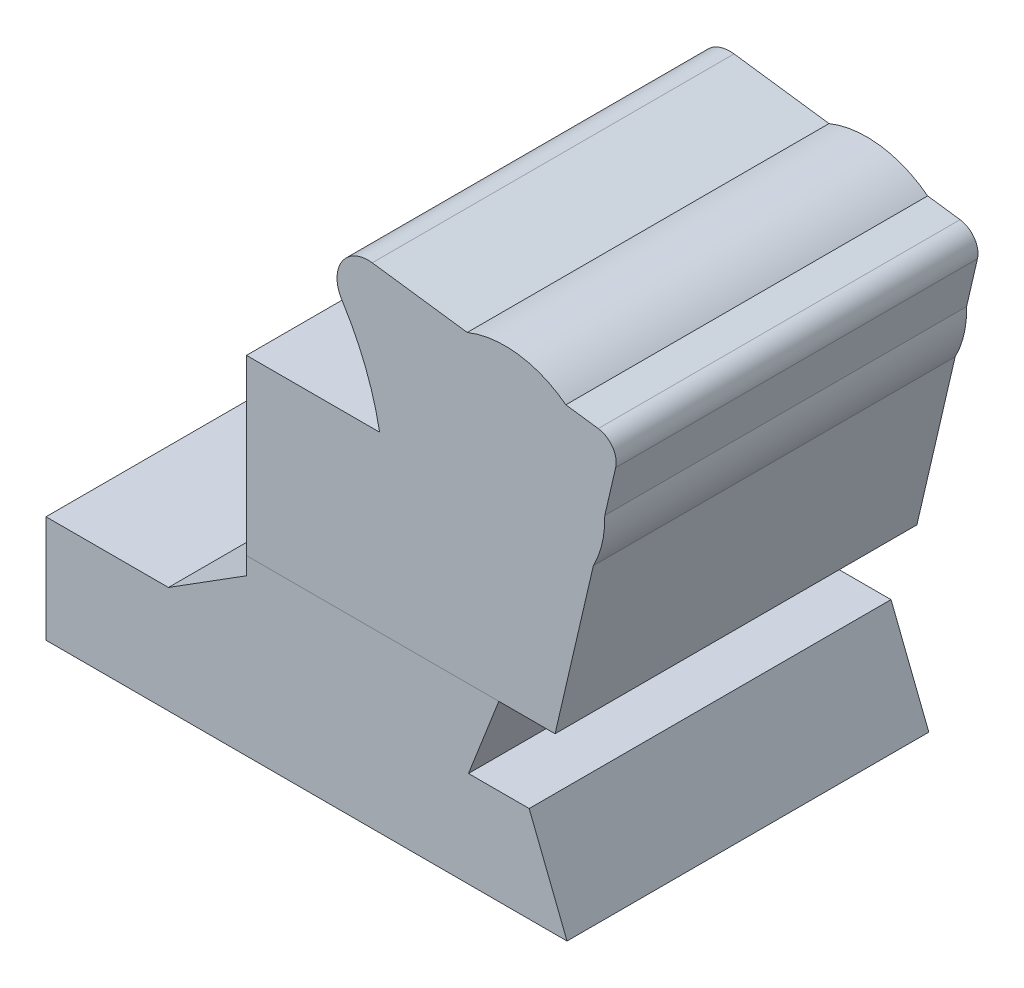
ISO-10303-21;
HEADER;
FILE_DESCRIPTION(('STEP AP214'),'2;1');
FILE_NAME('part.step','',(''),(''),'','','');
FILE_SCHEMA(('AUTOMOTIVE_DESIGN { 1 0 10303 214 1 1 1 1 }'));
ENDSEC;
DATA;
#1=APPLICATION_CONTEXT('core data for automotive mechanical design processes');
#2=APPLICATION_PROTOCOL_DEFINITION('international standard','automotive_design',2000,#1);
#3=PRODUCT_CONTEXT('',#1,'mechanical');
#4=PRODUCT('Part','Part','',(#3));
#5=PRODUCT_RELATED_PRODUCT_CATEGORY('part','',(#4));
#6=PRODUCT_DEFINITION_FORMATION('','',#4);
#7=PRODUCT_DEFINITION_CONTEXT('part definition',#1,'design');
#8=PRODUCT_DEFINITION('design','',#6,#7);
#9=PRODUCT_DEFINITION_SHAPE('','',#8);
#10=(LENGTH_UNIT() NAMED_UNIT(*) SI_UNIT(.MILLI.,.METRE.));
#11=(NAMED_UNIT(*) PLANE_ANGLE_UNIT() SI_UNIT($,.RADIAN.));
#12=(NAMED_UNIT(*) SI_UNIT($,.STERADIAN.) SOLID_ANGLE_UNIT());
#13=UNCERTAINTY_MEASURE_WITH_UNIT(LENGTH_MEASURE(1.E-05),#10,'distance_accuracy_value','');
#14=(GEOMETRIC_REPRESENTATION_CONTEXT(3) GLOBAL_UNCERTAINTY_ASSIGNED_CONTEXT((#13)) GLOBAL_UNIT_ASSIGNED_CONTEXT((#10,
#11,#12)) REPRESENTATION_CONTEXT('',''));
#15=CARTESIAN_POINT('',(0.,0.,0.));
#16=DIRECTION('',(0.,0.,1.));
#17=DIRECTION('',(1.,0.,0.));
#18=AXIS2_PLACEMENT_3D('',#15,#16,#17);
#19=CARTESIAN_POINT('',(125.156200350633,47.9623912919101,-50.01));
#20=DIRECTION('',(0.,1.,0.));
#21=DIRECTION('',(0.,0.,1.));
#22=AXIS2_PLACEMENT_3D('',#19,#20,#21);
#23=PLANE('',#22);
#24=DIRECTION('',(0.,0.,-1.));
#25=VECTOR('',#24,1.);
#26=CARTESIAN_POINT('',(125.156200350633,47.9623912919101,50.));
#27=LINE('',#26,#25);
#28=CARTESIAN_POINT('',(125.156200350633,47.9623912919101,50.));
#29=VERTEX_POINT('',#28);
#30=CARTESIAN_POINT('',(125.156200350633,47.9623912919101,-50.));
#31=VERTEX_POINT('',#30);
#32=EDGE_CURVE('E224',#29,#31,#27,.T.);
#33=ORIENTED_EDGE('',*,*,#32,.T.);
#34=DIRECTION('',(-1.,0.,0.));
#35=VECTOR('',#34,1.);
#36=CARTESIAN_POINT('',(0.,47.9623912919101,-50.));
#37=LINE('',#36,#35);
#38=CARTESIAN_POINT('',(55.4044049790674,47.9623912919101,-50.));
#39=VERTEX_POINT('',#38);
#40=EDGE_CURVE('E221',#31,#39,#37,.T.);
#41=ORIENTED_EDGE('',*,*,#40,.T.);
#42=DIRECTION('',(0.,0.,-1.));
#43=VECTOR('',#42,1.);
#44=CARTESIAN_POINT('',(55.4044049790674,47.9623912919101,50.));
#45=LINE('',#44,#43);
#46=CARTESIAN_POINT('',(55.4044049790674,47.9623912919101,50.));
#47=VERTEX_POINT('',#46);
#48=EDGE_CURVE('E215',#47,#39,#45,.T.);
#49=ORIENTED_EDGE('',*,*,#48,.F.);
#50=DIRECTION('',(-1.,0.,0.));
#51=VECTOR('',#50,1.);
#52=CARTESIAN_POINT('',(0.,47.9623912919101,50.));
#53=LINE('',#52,#51);
#54=EDGE_CURVE('E218',#29,#47,#53,.T.);
#55=ORIENTED_EDGE('',*,*,#54,.F.);
#56=EDGE_LOOP('',(#33,#41,#49,#55));
#57=FACE_BOUND('',#56,.T.);
#58=ADVANCED_FACE('F100',(#57),#23,.T.);
#59=CARTESIAN_POINT('',(0.,0.,-50.));
#60=DIRECTION('',(0.,0.,1.));
#61=DIRECTION('',(1.,0.,0.));
#62=AXIS2_PLACEMENT_3D('',#59,#60,#61);
#63=PLANE('',#62);
#64=ORIENTED_EDGE('',*,*,#40,.F.);
#65=DIRECTION('',(0.363850527140363,0.931457349479664,0.));
#66=VECTOR('',#65,1.);
#67=CARTESIAN_POINT('',(92.3321267886473,-36.0672370268024,-50.));
#68=LINE('',#67,#66);
#69=CARTESIAN_POINT('',(116.770080258154,26.4939238551565,-50.));
#70=VERTEX_POINT('',#69);
#71=EDGE_CURVE('E226',#70,#31,#68,.T.);
#72=ORIENTED_EDGE('',*,*,#71,.F.);
#73=DIRECTION('',(-1.,0.,0.));
#74=VECTOR('',#73,1.);
#75=CARTESIAN_POINT('',(0.,26.4939238551565,-50.));
#76=LINE('',#75,#74);
#77=CARTESIAN_POINT('',(133.542320443112,26.4939238551565,-50.));
#78=VERTEX_POINT('',#77);
#79=EDGE_CURVE('E154',#78,#70,#76,.T.);
#80=ORIENTED_EDGE('',*,*,#79,.F.);
#81=DIRECTION('',(-0.367183293175132,0.930148605983509,0.));
#82=VECTOR('',#81,1.);
#83=CARTESIAN_POINT('',(124.586270983111,49.1813856083972,-50.));
#84=LINE('',#83,#82);
#85=CARTESIAN_POINT('',(144.001,0.,-50.));
#86=VERTEX_POINT('',#85);
#87=EDGE_CURVE('E194',#86,#78,#84,.T.);
#88=ORIENTED_EDGE('',*,*,#87,.F.);
#89=DIRECTION('',(1.,0.,0.));
#90=VECTOR('',#89,1.);
#91=CARTESIAN_POINT('',(0.,0.,-50.));
#92=LINE('',#91,#90);
#93=CARTESIAN_POINT('',(0.,0.,-50.));
#94=VERTEX_POINT('',#93);
#95=EDGE_CURVE('E192',#94,#86,#92,.T.);
#96=ORIENTED_EDGE('',*,*,#95,.F.);
#97=DIRECTION('',(0.,1.,0.));
#98=VECTOR('',#97,1.);
#99=CARTESIAN_POINT('',(0.,0.,-50.));
#100=LINE('',#99,#98);
#101=CARTESIAN_POINT('',(0.,29.5569477873395,-50.));
#102=VERTEX_POINT('',#101);
#103=EDGE_CURVE('E174',#94,#102,#100,.T.);
#104=ORIENTED_EDGE('',*,*,#103,.T.);
#105=DIRECTION('',(1.,0.,0.));
#106=VECTOR('',#105,1.);
#107=CARTESIAN_POINT('',(0.,29.5569477873395,-50.));
#108=LINE('',#107,#106);
#109=CARTESIAN_POINT('',(33.8411284964257,29.5569477873395,-50.));
#110=VERTEX_POINT('',#109);
#111=EDGE_CURVE('E183',#102,#110,#108,.T.);
#112=ORIENTED_EDGE('',*,*,#111,.T.);
#113=DIRECTION('',(0.846232840089753,0.532813269686136,0.));
#114=VECTOR('',#113,1.);
#115=CARTESIAN_POINT('',(-3.71960009717276,5.90760015433326,-50.));
#116=LINE('',#115,#114);
#117=CARTESIAN_POINT('',(55.4044049790674,43.1338255727064,-50.));
#118=VERTEX_POINT('',#117);
#119=EDGE_CURVE('E109',#110,#118,#116,.T.);
#120=ORIENTED_EDGE('',*,*,#119,.T.);
#121=DIRECTION('',(0.,1.,0.));
#122=VECTOR('',#121,1.);
#123=CARTESIAN_POINT('',(55.4044049790674,0.,-50.));
#124=LINE('',#123,#122);
#125=EDGE_CURVE('E13',#118,#39,#124,.T.);
#126=ORIENTED_EDGE('',*,*,#125,.T.);
#127=EDGE_LOOP('',(#64,#72,#80,#88,#96,#104,#112,#120,#126));
#128=FACE_BOUND('',#127,.T.);
#129=ADVANCED_FACE('F190',(#128),#63,.F.);
#130=CARTESIAN_POINT('',(0.,0.,50.));
#131=DIRECTION('',(0.,0.,1.));
#132=DIRECTION('',(1.,0.,0.));
#133=AXIS2_PLACEMENT_3D('',#130,#131,#132);
#134=PLANE('',#133);
#135=DIRECTION('',(0.363850527140363,0.931457349479664,0.));
#136=VECTOR('',#135,1.);
#137=CARTESIAN_POINT('',(92.3321267886473,-36.0672370268024,50.));
#138=LINE('',#137,#136);
#139=CARTESIAN_POINT('',(116.770080258154,26.4939238551565,50.));
#140=VERTEX_POINT('',#139);
#141=EDGE_CURVE('E199',#140,#29,#138,.T.);
#142=ORIENTED_EDGE('',*,*,#141,.T.);
#143=ORIENTED_EDGE('',*,*,#54,.T.);
#144=DIRECTION('',(0.,1.,0.));
#145=VECTOR('',#144,1.);
#146=CARTESIAN_POINT('',(55.4044049790674,0.,50.));
#147=LINE('',#146,#145);
#148=CARTESIAN_POINT('',(55.4044049790674,43.1338255727064,50.));
#149=VERTEX_POINT('',#148);
#150=EDGE_CURVE('E214',#149,#47,#147,.T.);
#151=ORIENTED_EDGE('',*,*,#150,.F.);
#152=DIRECTION('',(0.846232840089753,0.532813269686136,0.));
#153=VECTOR('',#152,1.);
#154=CARTESIAN_POINT('',(-3.71960009717276,5.90760015433326,50.));
#155=LINE('',#154,#153);
#156=CARTESIAN_POINT('',(33.8411284964257,29.5569477873395,50.));
#157=VERTEX_POINT('',#156);
#158=EDGE_CURVE('E212',#157,#149,#155,.T.);
#159=ORIENTED_EDGE('',*,*,#158,.F.);
#160=DIRECTION('',(1.,0.,0.));
#161=VECTOR('',#160,1.);
#162=CARTESIAN_POINT('',(0.,29.5569477873395,50.));
#163=LINE('',#162,#161);
#164=CARTESIAN_POINT('',(0.,29.5569477873395,50.));
#165=VERTEX_POINT('',#164);
#166=EDGE_CURVE('E210',#165,#157,#163,.T.);
#167=ORIENTED_EDGE('',*,*,#166,.F.);
#168=DIRECTION('',(0.,1.,0.));
#169=VECTOR('',#168,1.);
#170=CARTESIAN_POINT('',(0.,0.,50.));
#171=LINE('',#170,#169);
#172=CARTESIAN_POINT('',(0.,0.,50.));
#173=VERTEX_POINT('',#172);
#174=EDGE_CURVE('E176',#173,#165,#171,.T.);
#175=ORIENTED_EDGE('',*,*,#174,.F.);
#176=DIRECTION('',(1.,0.,0.));
#177=VECTOR('',#176,1.);
#178=CARTESIAN_POINT('',(0.,0.,50.));
#179=LINE('',#178,#177);
#180=CARTESIAN_POINT('',(144.001,0.,50.));
#181=VERTEX_POINT('',#180);
#182=EDGE_CURVE('E207',#173,#181,#179,.T.);
#183=ORIENTED_EDGE('',*,*,#182,.T.);
#184=DIRECTION('',(-0.367183293175132,0.930148605983509,0.));
#185=VECTOR('',#184,1.);
#186=CARTESIAN_POINT('',(124.586270983111,49.1813856083972,50.));
#187=LINE('',#186,#185);
#188=CARTESIAN_POINT('',(133.542320443112,26.4939238551565,50.));
#189=VERTEX_POINT('',#188);
#190=EDGE_CURVE('E205',#181,#189,#187,.T.);
#191=ORIENTED_EDGE('',*,*,#190,.T.);
#192=DIRECTION('',(-1.,0.,0.));
#193=VECTOR('',#192,1.);
#194=CARTESIAN_POINT('',(0.,26.4939238551565,50.));
#195=LINE('',#194,#193);
#196=EDGE_CURVE('E202',#189,#140,#195,.T.);
#197=ORIENTED_EDGE('',*,*,#196,.T.);
#198=EDGE_LOOP('',(#142,#143,#151,#159,#167,#175,#183,#191,#197));
#199=FACE_BOUND('',#198,.T.);
#200=ADVANCED_FACE('F264',(#199),#134,.T.);
#201=CARTESIAN_POINT('',(55.4044049790674,0.,50.));
#202=DIRECTION('',(-1.,0.,0.));
#203=DIRECTION('',(0.,-1.,0.));
#204=AXIS2_PLACEMENT_3D('',#201,#202,#203);
#205=PLANE('',#204);
#206=ORIENTED_EDGE('',*,*,#150,.T.);
#207=ORIENTED_EDGE('',*,*,#48,.T.);
#208=ORIENTED_EDGE('',*,*,#125,.F.);
#209=DIRECTION('',(0.,0.,-1.));
#210=VECTOR('',#209,1.);
#211=CARTESIAN_POINT('',(55.4044049790674,43.1338255727064,50.));
#212=LINE('',#211,#210);
#213=EDGE_CURVE('E117',#149,#118,#212,.T.);
#214=ORIENTED_EDGE('',*,*,#213,.F.);
#215=EDGE_LOOP('',(#206,#207,#208,#214));
#216=FACE_BOUND('',#215,.T.);
#217=ADVANCED_FACE('F102',(#216),#205,.T.);
#218=CARTESIAN_POINT('',(-3.71960009717276,5.90760015433326,50.));
#219=DIRECTION('',(-0.532813269686136,0.846232840089753,0.));
#220=DIRECTION('',(-0.846232840089753,-0.532813269686136,0.));
#221=AXIS2_PLACEMENT_3D('',#218,#219,#220);
#222=PLANE('',#221);
#223=ORIENTED_EDGE('',*,*,#119,.F.);
#224=DIRECTION('',(0.,0.,-1.));
#225=VECTOR('',#224,1.);
#226=CARTESIAN_POINT('',(33.8411284964257,29.5569477873395,50.));
#227=LINE('',#226,#225);
#228=EDGE_CURVE('E141',#157,#110,#227,.T.);
#229=ORIENTED_EDGE('',*,*,#228,.F.);
#230=ORIENTED_EDGE('',*,*,#158,.T.);
#231=ORIENTED_EDGE('',*,*,#213,.T.);
#232=EDGE_LOOP('',(#223,#229,#230,#231));
#233=FACE_BOUND('',#232,.T.);
#234=ADVANCED_FACE('F256',(#233),#222,.T.);
#235=CARTESIAN_POINT('',(0.,29.5569477873395,50.));
#236=DIRECTION('',(0.,1.,0.));
#237=DIRECTION('',(0.,0.,1.));
#238=AXIS2_PLACEMENT_3D('',#235,#236,#237);
#239=PLANE('',#238);
#240=ORIENTED_EDGE('',*,*,#111,.F.);
#241=DIRECTION('',(0.,0.,-1.));
#242=VECTOR('',#241,1.);
#243=CARTESIAN_POINT('',(0.,29.5569477873395,50.));
#244=LINE('',#243,#242);
#245=EDGE_CURVE('E170',#165,#102,#244,.T.);
#246=ORIENTED_EDGE('',*,*,#245,.F.);
#247=ORIENTED_EDGE('',*,*,#166,.T.);
#248=ORIENTED_EDGE('',*,*,#228,.T.);
#249=EDGE_LOOP('',(#240,#246,#247,#248));
#250=FACE_BOUND('',#249,.T.);
#251=ADVANCED_FACE('F184',(#250),#239,.T.);
#252=CARTESIAN_POINT('',(0.,0.,50.));
#253=DIRECTION('',(-1.,0.,0.));
#254=DIRECTION('',(0.,0.,1.));
#255=AXIS2_PLACEMENT_3D('',#252,#253,#254);
#256=PLANE('',#255);
#257=ORIENTED_EDGE('',*,*,#103,.F.);
#258=DIRECTION('',(0.,0.,-1.));
#259=VECTOR('',#258,1.);
#260=CARTESIAN_POINT('',(0.,0.,50.));
#261=LINE('',#260,#259);
#262=EDGE_CURVE('E180',#173,#94,#261,.T.);
#263=ORIENTED_EDGE('',*,*,#262,.F.);
#264=ORIENTED_EDGE('',*,*,#174,.T.);
#265=ORIENTED_EDGE('',*,*,#245,.T.);
#266=EDGE_LOOP('',(#257,#263,#264,#265));
#267=FACE_BOUND('',#266,.T.);
#268=ADVANCED_FACE('F172',(#267),#256,.T.);
#269=CARTESIAN_POINT('',(0.,0.,50.));
#270=DIRECTION('',(0.,1.,0.));
#271=DIRECTION('',(0.,0.,1.));
#272=AXIS2_PLACEMENT_3D('',#269,#270,#271);
#273=PLANE('',#272);
#274=ORIENTED_EDGE('',*,*,#95,.T.);
#275=DIRECTION('',(0.,0.,-1.));
#276=VECTOR('',#275,1.);
#277=CARTESIAN_POINT('',(144.001,0.,50.));
#278=LINE('',#277,#276);
#279=EDGE_CURVE('E245',#181,#86,#278,.T.);
#280=ORIENTED_EDGE('',*,*,#279,.F.);
#281=ORIENTED_EDGE('',*,*,#182,.F.);
#282=ORIENTED_EDGE('',*,*,#262,.T.);
#283=EDGE_LOOP('',(#274,#280,#281,#282));
#284=FACE_BOUND('',#283,.T.);
#285=ADVANCED_FACE('F279',(#284),#273,.F.);
#286=CARTESIAN_POINT('',(124.586270983111,49.1813856083972,50.));
#287=DIRECTION('',(-0.930148605983509,-0.367183293175132,0.));
#288=DIRECTION('',(0.367183293175132,-0.930148605983509,0.));
#289=AXIS2_PLACEMENT_3D('',#286,#287,#288);
#290=PLANE('',#289);
#291=ORIENTED_EDGE('',*,*,#87,.T.);
#292=DIRECTION('',(0.,0.,-1.));
#293=VECTOR('',#292,1.);
#294=CARTESIAN_POINT('',(133.542320443112,26.4939238551565,50.));
#295=LINE('',#294,#293);
#296=EDGE_CURVE('E242',#189,#78,#295,.T.);
#297=ORIENTED_EDGE('',*,*,#296,.F.);
#298=ORIENTED_EDGE('',*,*,#190,.F.);
#299=ORIENTED_EDGE('',*,*,#279,.T.);
#300=EDGE_LOOP('',(#291,#297,#298,#299));
#301=FACE_BOUND('',#300,.T.);
#302=ADVANCED_FACE('F240',(#301),#290,.F.);
#303=CARTESIAN_POINT('',(0.,26.4939238551565,50.));
#304=DIRECTION('',(0.,-1.,0.));
#305=DIRECTION('',(0.,0.,-1.));
#306=AXIS2_PLACEMENT_3D('',#303,#304,#305);
#307=PLANE('',#306);
#308=ORIENTED_EDGE('',*,*,#79,.T.);
#309=DIRECTION('',(0.,0.,-1.));
#310=VECTOR('',#309,1.);
#311=CARTESIAN_POINT('',(116.770080258154,26.4939238551565,50.));
#312=LINE('',#311,#310);
#313=EDGE_CURVE('E203',#140,#70,#312,.T.);
#314=ORIENTED_EDGE('',*,*,#313,.F.);
#315=ORIENTED_EDGE('',*,*,#196,.F.);
#316=ORIENTED_EDGE('',*,*,#296,.T.);
#317=EDGE_LOOP('',(#308,#314,#315,#316));
#318=FACE_BOUND('',#317,.T.);
#319=ADVANCED_FACE('F246',(#318),#307,.F.);
#320=CARTESIAN_POINT('',(92.3321267886473,-36.0672370268024,50.));
#321=DIRECTION('',(-0.931457349479664,0.363850527140362,0.));
#322=DIRECTION('',(-0.363850527140363,-0.931457349479664,0.));
#323=AXIS2_PLACEMENT_3D('',#320,#321,#322);
#324=PLANE('',#323);
#325=ORIENTED_EDGE('',*,*,#71,.T.);
#326=ORIENTED_EDGE('',*,*,#32,.F.);
#327=ORIENTED_EDGE('',*,*,#141,.F.);
#328=ORIENTED_EDGE('',*,*,#313,.T.);
#329=EDGE_LOOP('',(#325,#326,#327,#328));
#330=FACE_BOUND('',#329,.T.);
#331=ADVANCED_FACE('F253',(#330),#324,.F.);
#332=CLOSED_SHELL('',(#58,#129,#200,#217,#234,#251,#268,#285,#302,#319,#331));
#333=MANIFOLD_SOLID_BREP('B2',#332);
#334=CARTESIAN_POINT('',(19.0917847936775,82.3258456075658,50.));
#335=DIRECTION('',(0.,0.,-1.));
#336=DIRECTION('',(-1.,0.,0.));
#337=AXIS2_PLACEMENT_3D('',#334,#335,#336);
#338=CYLINDRICAL_SURFACE('',#337,74.3600000001127);
#339=CARTESIAN_POINT('',(19.0917847936775,82.3258456075658,-50.));
#340=DIRECTION('',(0.,0.,1.));
#341=DIRECTION('',(1.,0.,0.));
#342=AXIS2_PLACEMENT_3D('',#339,#340,#341);
#343=CIRCLE('',#342,74.3600000001127);
#344=CARTESIAN_POINT('',(81.786119565483,122.311217777117,-50.));
#345=VERTEX_POINT('',#344);
#346=CARTESIAN_POINT('',(92.2028645129567,95.8971249244899,-50.));
#347=VERTEX_POINT('',#346);
#348=EDGE_CURVE('E518',#345,#347,#343,.F.);
#349=ORIENTED_EDGE('',*,*,#348,.T.);
#350=DIRECTION('',(0.,0.,-1.));
#351=VECTOR('',#350,1.);
#352=CARTESIAN_POINT('',(92.2028645129567,95.8971249244899,50.));
#353=LINE('',#352,#351);
#354=CARTESIAN_POINT('',(92.2028645129567,95.8971249244899,50.));
#355=VERTEX_POINT('',#354);
#356=EDGE_CURVE('E533',#355,#347,#353,.T.);
#357=ORIENTED_EDGE('',*,*,#356,.F.);
#358=CARTESIAN_POINT('',(19.0917847936775,82.3258456075658,50.));
#359=DIRECTION('',(0.,0.,1.));
#360=DIRECTION('',(1.,0.,0.));
#361=AXIS2_PLACEMENT_3D('',#358,#359,#360);
#362=CIRCLE('',#361,74.3600000001127);
#363=CARTESIAN_POINT('',(81.786119565483,122.311217777117,50.));
#364=VERTEX_POINT('',#363);
#365=EDGE_CURVE('E563',#364,#355,#362,.F.);
#366=ORIENTED_EDGE('',*,*,#365,.F.);
#367=DIRECTION('',(0.,0.,-1.));
#368=VECTOR('',#367,1.);
#369=CARTESIAN_POINT('',(81.786119565483,122.311217777117,50.));
#370=LINE('',#369,#368);
#371=EDGE_CURVE('E535',#364,#345,#370,.T.);
#372=ORIENTED_EDGE('',*,*,#371,.T.);
#373=EDGE_LOOP('',(#349,#357,#366,#372));
#374=FACE_BOUND('',#373,.T.);
#375=ADVANCED_FACE('F371',(#374),#338,.F.);
#376=CARTESIAN_POINT('',(89.0200812699105,126.924914565904,50.));
#377=DIRECTION('',(0.,0.,-1.));
#378=DIRECTION('',(-1.,0.,0.));
#379=AXIS2_PLACEMENT_3D('',#376,#377,#378);
#380=CYLINDRICAL_SURFACE('',#379,8.57999999999931);
#381=CARTESIAN_POINT('',(89.0200812699105,126.924914565904,-50.));
#382=DIRECTION('',(0.,0.,1.));
#383=DIRECTION('',(1.,0.,0.));
#384=AXIS2_PLACEMENT_3D('',#381,#382,#383);
#385=CIRCLE('',#384,8.57999999999931);
#386=CARTESIAN_POINT('',(90.1698066016005,135.427533671901,-50.));
#387=VERTEX_POINT('',#386);
#388=EDGE_CURVE('E516',#387,#345,#385,.T.);
#389=ORIENTED_EDGE('',*,*,#388,.T.);
#390=ORIENTED_EDGE('',*,*,#371,.F.);
#391=CARTESIAN_POINT('',(89.0200812699105,126.924914565904,50.));
#392=DIRECTION('',(0.,0.,1.));
#393=DIRECTION('',(1.,0.,0.));
#394=AXIS2_PLACEMENT_3D('',#391,#392,#393);
#395=CIRCLE('',#394,8.57999999999931);
#396=CARTESIAN_POINT('',(90.1698066016005,135.427533671901,50.));
#397=VERTEX_POINT('',#396);
#398=EDGE_CURVE('E561',#397,#364,#395,.T.);
#399=ORIENTED_EDGE('',*,*,#398,.F.);
#400=DIRECTION('',(0.,0.,-1.));
#401=VECTOR('',#400,1.);
#402=CARTESIAN_POINT('',(90.1698066016005,135.427533671901,50.));
#403=LINE('',#402,#401);
#404=EDGE_CURVE('E538',#397,#387,#403,.T.);
#405=ORIENTED_EDGE('',*,*,#404,.T.);
#406=EDGE_LOOP('',(#389,#390,#399,#405));
#407=FACE_BOUND('',#406,.T.);
#408=ADVANCED_FACE('F559',(#407),#380,.T.);
#409=CARTESIAN_POINT('',(19.6028110655159,144.969612569904,50.));
#410=DIRECTION('',(-0.134000621409096,-0.990981247785232,0.));
#411=DIRECTION('',(0.990981247785232,-0.134000621409096,0.));
#412=AXIS2_PLACEMENT_3D('',#409,#410,#411);
#413=PLANE('',#412);
#414=DIRECTION('',(-0.990981247785232,0.134000621409096,0.));
#415=VECTOR('',#414,1.);
#416=CARTESIAN_POINT('',(19.6028110655159,144.969612569904,-50.));
#417=LINE('',#416,#415);
#418=CARTESIAN_POINT('',(116.418600533637,131.878168125385,-50.));
#419=VERTEX_POINT('',#418);
#420=EDGE_CURVE('E514',#419,#387,#417,.T.);
#421=ORIENTED_EDGE('',*,*,#420,.T.);
#422=ORIENTED_EDGE('',*,*,#404,.F.);
#423=DIRECTION('',(-0.990981247785232,0.134000621409096,0.));
#424=VECTOR('',#423,1.);
#425=CARTESIAN_POINT('',(19.6028110655159,144.969612569904,50.));
#426=LINE('',#425,#424);
#427=CARTESIAN_POINT('',(116.418600533637,131.878168125385,50.));
#428=VERTEX_POINT('',#427);
#429=EDGE_CURVE('E564',#428,#397,#426,.T.);
#430=ORIENTED_EDGE('',*,*,#429,.F.);
#431=DIRECTION('',(0.,0.,-1.));
#432=VECTOR('',#431,1.);
#433=CARTESIAN_POINT('',(116.418600533637,131.878168125385,50.));
#434=LINE('',#433,#432);
#435=EDGE_CURVE('E541',#428,#419,#434,.T.);
#436=ORIENTED_EDGE('',*,*,#435,.T.);
#437=EDGE_LOOP('',(#421,#422,#430,#436));
#438=FACE_BOUND('',#437,.T.);
#439=ADVANCED_FACE('F555',(#438),#413,.F.);
#440=CARTESIAN_POINT('',(126.840999999996,106.3205,50.));
#441=DIRECTION('',(0.,0.,-1.));
#442=DIRECTION('',(-1.,0.,0.));
#443=AXIS2_PLACEMENT_3D('',#440,#441,#442);
#444=CYLINDRICAL_SURFACE('',#443,27.6011016201112);
#445=CARTESIAN_POINT('',(126.840999999996,106.3205,-50.));
#446=DIRECTION('',(0.,0.,1.));
#447=DIRECTION('',(1.,0.,0.));
#448=AXIS2_PLACEMENT_3D('',#445,#446,#447);
#449=CIRCLE('',#448,27.6011016201112);
#450=CARTESIAN_POINT('',(143.676819781968,128.192307947965,-50.));
#451=VERTEX_POINT('',#450);
#452=EDGE_CURVE('E511',#451,#419,#449,.T.);
#453=ORIENTED_EDGE('',*,*,#452,.T.);
#454=ORIENTED_EDGE('',*,*,#435,.F.);
#455=CARTESIAN_POINT('',(126.840999999996,106.3205,50.));
#456=DIRECTION('',(0.,0.,1.));
#457=DIRECTION('',(1.,0.,0.));
#458=AXIS2_PLACEMENT_3D('',#455,#456,#457);
#459=CIRCLE('',#458,27.6011016201112);
#460=CARTESIAN_POINT('',(143.676819781968,128.192307947965,50.));
#461=VERTEX_POINT('',#460);
#462=EDGE_CURVE('E548',#461,#428,#459,.T.);
#463=ORIENTED_EDGE('',*,*,#462,.F.);
#464=DIRECTION('',(0.,0.,-1.));
#465=VECTOR('',#464,1.);
#466=CARTESIAN_POINT('',(143.676819781968,128.192307947965,50.));
#467=LINE('',#466,#465);
#468=EDGE_CURVE('E489',#461,#451,#467,.T.);
#469=ORIENTED_EDGE('',*,*,#468,.T.);
#470=EDGE_LOOP('',(#453,#454,#463,#469));
#471=FACE_BOUND('',#470,.T.);
#472=ADVANCED_FACE('F544',(#471),#444,.T.);
#473=CARTESIAN_POINT('',(19.6028110655159,144.969612569904,50.));
#474=DIRECTION('',(-0.134000621409096,-0.990981247785232,0.));
#475=DIRECTION('',(0.990981247785232,-0.134000621409096,0.));
#476=AXIS2_PLACEMENT_3D('',#473,#474,#475);
#477=PLANE('',#476);
#478=DIRECTION('',(-0.990981247785232,0.134000621409096,0.));
#479=VECTOR('',#478,1.);
#480=CARTESIAN_POINT('',(19.6028110655159,144.969612569904,-50.));
#481=LINE('',#480,#479);
#482=CARTESIAN_POINT('',(152.63248355446,126.981321853801,-50.));
#483=VERTEX_POINT('',#482);
#484=EDGE_CURVE('E508',#483,#451,#481,.T.);
#485=ORIENTED_EDGE('',*,*,#484,.T.);
#486=ORIENTED_EDGE('',*,*,#468,.F.);
#487=DIRECTION('',(-0.990981247785232,0.134000621409096,0.));
#488=VECTOR('',#487,1.);
#489=CARTESIAN_POINT('',(19.6028110655159,144.969612569904,50.));
#490=LINE('',#489,#488);
#491=CARTESIAN_POINT('',(152.63248355446,126.981321853801,50.));
#492=VERTEX_POINT('',#491);
#493=EDGE_CURVE('E480',#492,#461,#490,.T.);
#494=ORIENTED_EDGE('',*,*,#493,.F.);
#495=DIRECTION('',(0.,0.,-1.));
#496=VECTOR('',#495,1.);
#497=CARTESIAN_POINT('',(152.63248355446,126.981321853801,50.));
#498=LINE('',#497,#496);
#499=EDGE_CURVE('E478',#492,#483,#498,.T.);
#500=ORIENTED_EDGE('',*,*,#499,.T.);
#501=EDGE_LOOP('',(#485,#486,#494,#500));
#502=FACE_BOUND('',#501,.T.);
#503=ADVANCED_FACE('F550',(#502),#477,.F.);
#504=CARTESIAN_POINT('',(151.866,121.31290911647,50.));
#505=DIRECTION('',(0.,0.,-1.));
#506=DIRECTION('',(-1.,0.,0.));
#507=AXIS2_PLACEMENT_3D('',#504,#505,#506);
#508=CYLINDRICAL_SURFACE('',#507,5.71999999999941);
#509=CARTESIAN_POINT('',(151.866,121.31290911647,-50.));
#510=DIRECTION('',(0.,0.,1.));
#511=DIRECTION('',(1.,0.,0.));
#512=AXIS2_PLACEMENT_3D('',#509,#510,#511);
#513=CIRCLE('',#512,5.71999999999941);
#514=CARTESIAN_POINT('',(157.437634446656,120.01857933128,-50.));
#515=VERTEX_POINT('',#514);
#516=EDGE_CURVE('E501',#515,#483,#513,.T.);
#517=ORIENTED_EDGE('',*,*,#516,.T.);
#518=ORIENTED_EDGE('',*,*,#499,.F.);
#519=CARTESIAN_POINT('',(151.866,121.31290911647,50.));
#520=DIRECTION('',(0.,0.,1.));
#521=DIRECTION('',(1.,0.,0.));
#522=AXIS2_PLACEMENT_3D('',#519,#520,#521);
#523=CIRCLE('',#522,5.71999999999941);
#524=CARTESIAN_POINT('',(157.437634446656,120.01857933128,50.));
#525=VERTEX_POINT('',#524);
#526=EDGE_CURVE('E464',#525,#492,#523,.T.);
#527=ORIENTED_EDGE('',*,*,#526,.F.);
#528=DIRECTION('',(0.,0.,-1.));
#529=VECTOR('',#528,1.);
#530=CARTESIAN_POINT('',(157.437634446656,120.01857933128,50.));
#531=LINE('',#530,#529);
#532=EDGE_CURVE('E476',#525,#515,#531,.T.);
#533=ORIENTED_EDGE('',*,*,#532,.T.);
#534=EDGE_LOOP('',(#517,#518,#527,#533));
#535=FACE_BOUND('',#534,.T.);
#536=ADVANCED_FACE('F475',(#535),#508,.T.);
#537=CARTESIAN_POINT('',(122.922758843375,-28.5558195843682,50.));
#538=DIRECTION('',(-0.974061966198679,0.226281430977365,0.));
#539=DIRECTION('',(-0.226281430977365,-0.974061966198679,0.));
#540=AXIS2_PLACEMENT_3D('',#537,#538,#539);
#541=PLANE('',#540);
#542=DIRECTION('',(0.,0.,-1.));
#543=VECTOR('',#542,1.);
#544=CARTESIAN_POINT('',(154.431677752707,107.078993104652,50.));
#545=LINE('',#544,#543);
#546=CARTESIAN_POINT('',(154.431677752707,107.078993104652,-50.));
#547=VERTEX_POINT('',#546);
#548=CARTESIAN_POINT('',(154.431677752707,107.078993104652,50.));
#549=VERTEX_POINT('',#548);
#550=EDGE_CURVE('E379',#547,#549,#545,.F.);
#551=ORIENTED_EDGE('',*,*,#550,.F.);
#552=DIRECTION('',(0.226281430977365,0.974061966198679,0.));
#553=VECTOR('',#552,1.);
#554=CARTESIAN_POINT('',(122.922758843375,-28.5558195843682,-50.));
#555=LINE('',#554,#553);
#556=EDGE_CURVE('E484',#547,#515,#555,.T.);
#557=ORIENTED_EDGE('',*,*,#556,.T.);
#558=ORIENTED_EDGE('',*,*,#532,.F.);
#559=DIRECTION('',(0.226281430977365,0.974061966198679,0.));
#560=VECTOR('',#559,1.);
#561=CARTESIAN_POINT('',(122.922758843375,-28.5558195843682,50.));
#562=LINE('',#561,#560);
#563=EDGE_CURVE('E459',#549,#525,#562,.T.);
#564=ORIENTED_EDGE('',*,*,#563,.F.);
#565=EDGE_LOOP('',(#551,#557,#558,#564));
#566=FACE_BOUND('',#565,.T.);
#567=ADVANCED_FACE('F482',(#566),#541,.F.);
#568=CARTESIAN_POINT('',(126.840999999996,106.3205,50.));
#569=DIRECTION('',(0.,0.,-1.));
#570=DIRECTION('',(-1.,0.,0.));
#571=AXIS2_PLACEMENT_3D('',#568,#569,#570);
#572=CYLINDRICAL_SURFACE('',#571,27.6011016201112);
#573=CARTESIAN_POINT('',(126.840999999996,106.3205,-50.));
#574=DIRECTION('',(0.,0.,1.));
#575=DIRECTION('',(1.,0.,0.));
#576=AXIS2_PLACEMENT_3D('',#573,#574,#575);
#577=CIRCLE('',#576,27.6011016201112);
#578=CARTESIAN_POINT('',(151.271848854584,93.4770411633782,-50.));
#579=VERTEX_POINT('',#578);
#580=EDGE_CURVE('E494',#579,#547,#577,.T.);
#581=ORIENTED_EDGE('',*,*,#580,.T.);
#582=ORIENTED_EDGE('',*,*,#550,.T.);
#583=CARTESIAN_POINT('',(126.840999999996,106.3205,50.));
#584=DIRECTION('',(0.,0.,1.));
#585=DIRECTION('',(1.,0.,0.));
#586=AXIS2_PLACEMENT_3D('',#583,#584,#585);
#587=CIRCLE('',#586,27.6011016201112);
#588=CARTESIAN_POINT('',(151.271848854584,93.4770411633782,50.));
#589=VERTEX_POINT('',#588);
#590=EDGE_CURVE('E468',#589,#549,#587,.T.);
#591=ORIENTED_EDGE('',*,*,#590,.F.);
#592=DIRECTION('',(0.,0.,-1.));
#593=VECTOR('',#592,1.);
#594=CARTESIAN_POINT('',(151.271848854584,93.4770411633782,50.));
#595=LINE('',#594,#593);
#596=EDGE_CURVE('E486',#589,#579,#595,.T.);
#597=ORIENTED_EDGE('',*,*,#596,.T.);
#598=EDGE_LOOP('',(#581,#582,#591,#597));
#599=FACE_BOUND('',#598,.T.);
#600=ADVANCED_FACE('F373',(#599),#572,.T.);
#601=CARTESIAN_POINT('',(0.,95.8971249244899,50.));
#602=DIRECTION('',(0.,1.,0.));
#603=DIRECTION('',(0.,0.,1.));
#604=AXIS2_PLACEMENT_3D('',#601,#602,#603);
#605=PLANE('',#604);
#606=DIRECTION('',(1.,0.,0.));
#607=VECTOR('',#606,1.);
#608=CARTESIAN_POINT('',(0.,95.8971249244899,-50.));
#609=LINE('',#608,#607);
#610=CARTESIAN_POINT('',(55.4044049790674,95.8971249244899,-50.));
#611=VERTEX_POINT('',#610);
#612=EDGE_CURVE('E521',#611,#347,#609,.T.);
#613=ORIENTED_EDGE('',*,*,#612,.F.);
#614=DIRECTION('',(0.,0.,-1.));
#615=VECTOR('',#614,1.);
#616=CARTESIAN_POINT('',(55.4044049790674,95.8971249244899,50.));
#617=LINE('',#616,#615);
#618=CARTESIAN_POINT('',(55.4044049790674,95.8971249244899,50.));
#619=VERTEX_POINT('',#618);
#620=EDGE_CURVE('E530',#619,#611,#617,.T.);
#621=ORIENTED_EDGE('',*,*,#620,.F.);
#622=DIRECTION('',(1.,0.,0.));
#623=VECTOR('',#622,1.);
#624=CARTESIAN_POINT('',(0.,95.8971249244899,50.));
#625=LINE('',#624,#623);
#626=EDGE_CURVE('E566',#619,#355,#625,.T.);
#627=ORIENTED_EDGE('',*,*,#626,.T.);
#628=ORIENTED_EDGE('',*,*,#356,.T.);
#629=EDGE_LOOP('',(#613,#621,#627,#628));
#630=FACE_BOUND('',#629,.T.);
#631=ADVANCED_FACE('F587',(#630),#605,.T.);
#632=CARTESIAN_POINT('',(0.,0.,50.));
#633=DIRECTION('',(0.,0.,1.));
#634=DIRECTION('',(1.,0.,0.));
#635=AXIS2_PLACEMENT_3D('',#632,#633,#634);
#636=PLANE('',#635);
#637=DIRECTION('',(0.,1.,0.));
#638=VECTOR('',#637,1.);
#639=CARTESIAN_POINT('',(55.4044049790674,0.,50.));
#640=LINE('',#639,#638);
#641=CARTESIAN_POINT('',(55.4044049790674,47.9623912919101,50.));
#642=VERTEX_POINT('',#641);
#643=EDGE_CURVE('E572',#642,#619,#640,.T.);
#644=ORIENTED_EDGE('',*,*,#643,.F.);
#645=DIRECTION('',(1.,0.,0.));
#646=VECTOR('',#645,1.);
#647=CARTESIAN_POINT('',(0.,47.9623912919101,50.));
#648=LINE('',#647,#646);
#649=CARTESIAN_POINT('',(140.698476255362,47.9623912919101,50.));
#650=VERTEX_POINT('',#649);
#651=EDGE_CURVE('E392',#642,#650,#648,.T.);
#652=ORIENTED_EDGE('',*,*,#651,.T.);
#653=EDGE_CURVE('E471',#650,#589,#562,.T.);
#654=ORIENTED_EDGE('',*,*,#653,.T.);
#655=ORIENTED_EDGE('',*,*,#590,.T.);
#656=ORIENTED_EDGE('',*,*,#563,.T.);
#657=ORIENTED_EDGE('',*,*,#526,.T.);
#658=ORIENTED_EDGE('',*,*,#493,.T.);
#659=ORIENTED_EDGE('',*,*,#462,.T.);
#660=ORIENTED_EDGE('',*,*,#429,.T.);
#661=ORIENTED_EDGE('',*,*,#398,.T.);
#662=ORIENTED_EDGE('',*,*,#365,.T.);
#663=ORIENTED_EDGE('',*,*,#626,.F.);
#664=EDGE_LOOP('',(#644,#652,#654,#655,#656,#657,#658,#659,#660,#661,#662,#663));
#665=FACE_BOUND('',#664,.T.);
#666=ADVANCED_FACE('F462',(#665),#636,.T.);
#667=ORIENTED_EDGE('',*,*,#596,.F.);
#668=ORIENTED_EDGE('',*,*,#653,.F.);
#669=DIRECTION('',(0.,0.,-1.));
#670=VECTOR('',#669,1.);
#671=CARTESIAN_POINT('',(140.698476255362,47.9623912919101,50.));
#672=LINE('',#671,#670);
#673=CARTESIAN_POINT('',(140.698476255362,47.9623912919101,-50.));
#674=VERTEX_POINT('',#673);
#675=EDGE_CURVE('E527',#650,#674,#672,.T.);
#676=ORIENTED_EDGE('',*,*,#675,.T.);
#677=EDGE_CURVE('E502',#674,#579,#555,.T.);
#678=ORIENTED_EDGE('',*,*,#677,.T.);
#679=EDGE_LOOP('',(#667,#668,#676,#678));
#680=FACE_BOUND('',#679,.T.);
#681=ADVANCED_FACE('F579',(#680),#541,.F.);
#682=CARTESIAN_POINT('',(0.,0.,-50.));
#683=DIRECTION('',(0.,0.,1.));
#684=DIRECTION('',(1.,0.,0.));
#685=AXIS2_PLACEMENT_3D('',#682,#683,#684);
#686=PLANE('',#685);
#687=DIRECTION('',(1.,0.,0.));
#688=VECTOR('',#687,1.);
#689=CARTESIAN_POINT('',(0.,47.9623912919101,-50.));
#690=LINE('',#689,#688);
#691=CARTESIAN_POINT('',(55.4044049790674,47.9623912919101,-50.));
#692=VERTEX_POINT('',#691);
#693=EDGE_CURVE('E386',#692,#674,#690,.T.);
#694=ORIENTED_EDGE('',*,*,#693,.F.);
#695=DIRECTION('',(0.,1.,0.));
#696=VECTOR('',#695,1.);
#697=CARTESIAN_POINT('',(55.4044049790674,0.,-50.));
#698=LINE('',#697,#696);
#699=EDGE_CURVE('E524',#692,#611,#698,.T.);
#700=ORIENTED_EDGE('',*,*,#699,.T.);
#701=ORIENTED_EDGE('',*,*,#612,.T.);
#702=ORIENTED_EDGE('',*,*,#348,.F.);
#703=ORIENTED_EDGE('',*,*,#388,.F.);
#704=ORIENTED_EDGE('',*,*,#420,.F.);
#705=ORIENTED_EDGE('',*,*,#452,.F.);
#706=ORIENTED_EDGE('',*,*,#484,.F.);
#707=ORIENTED_EDGE('',*,*,#516,.F.);
#708=ORIENTED_EDGE('',*,*,#556,.F.);
#709=ORIENTED_EDGE('',*,*,#580,.F.);
#710=ORIENTED_EDGE('',*,*,#677,.F.);
#711=EDGE_LOOP('',(#694,#700,#701,#702,#703,#704,#705,#706,#707,#708,#709,#710));
#712=FACE_BOUND('',#711,.T.);
#713=ADVANCED_FACE('F499',(#712),#686,.F.);
#714=CARTESIAN_POINT('',(0.,47.9623912919101,50.));
#715=DIRECTION('',(0.,1.,0.));
#716=DIRECTION('',(0.,0.,1.));
#717=AXIS2_PLACEMENT_3D('',#714,#715,#716);
#718=PLANE('',#717);
#719=ORIENTED_EDGE('',*,*,#693,.T.);
#720=ORIENTED_EDGE('',*,*,#675,.F.);
#721=ORIENTED_EDGE('',*,*,#651,.F.);
#722=DIRECTION('',(0.,0.,-1.));
#723=VECTOR('',#722,1.);
#724=CARTESIAN_POINT('',(55.4044049790674,47.9623912919101,50.));
#725=LINE('',#724,#723);
#726=EDGE_CURVE('E98',#642,#692,#725,.T.);
#727=ORIENTED_EDGE('',*,*,#726,.T.);
#728=EDGE_LOOP('',(#719,#720,#721,#727));
#729=FACE_BOUND('',#728,.T.);
#730=ADVANCED_FACE('F577',(#729),#718,.F.);
#731=CARTESIAN_POINT('',(55.4044049790674,0.,50.));
#732=DIRECTION('',(-1.,0.,0.));
#733=DIRECTION('',(0.,-1.,0.));
#734=AXIS2_PLACEMENT_3D('',#731,#732,#733);
#735=PLANE('',#734);
#736=ORIENTED_EDGE('',*,*,#726,.F.);
#737=ORIENTED_EDGE('',*,*,#643,.T.);
#738=ORIENTED_EDGE('',*,*,#620,.T.);
#739=ORIENTED_EDGE('',*,*,#699,.F.);
#740=EDGE_LOOP('',(#736,#737,#738,#739));
#741=FACE_BOUND('',#740,.T.);
#742=ADVANCED_FACE('F591',(#741),#735,.T.);
#743=CLOSED_SHELL('',(#375,#408,#439,#472,#503,#536,#567,#600,#631,#666,#681,#713,#730,#742));
#744=MANIFOLD_SOLID_BREP('B7',#743);
#745=ADVANCED_BREP_SHAPE_REPRESENTATION('',(#18,#333,#744),#14);
#746=SHAPE_DEFINITION_REPRESENTATION(#9,#745);
ENDSEC;
END-ISO-10303-21;
